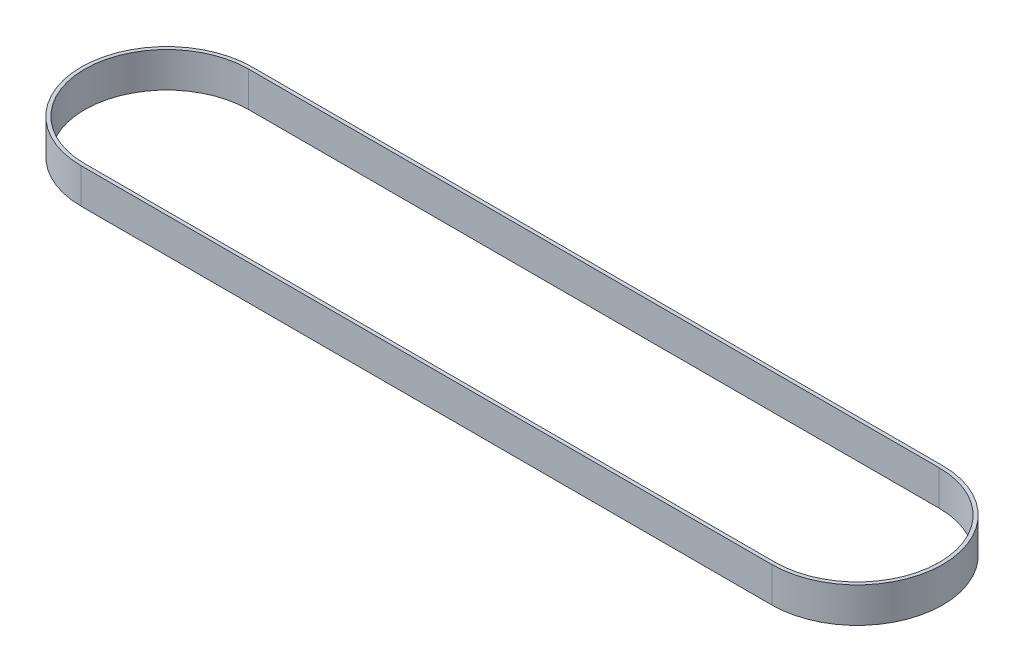
ISO-10303-21;
HEADER;
FILE_DESCRIPTION(('STEP AP214'),'2;1');
FILE_NAME('part.step','',(''),(''),'','','');
FILE_SCHEMA(('AUTOMOTIVE_DESIGN { 1 0 10303 214 1 1 1 1 }'));
ENDSEC;
DATA;
#1=APPLICATION_CONTEXT('core data for automotive mechanical design processes');
#2=APPLICATION_PROTOCOL_DEFINITION('international standard','automotive_design',2000,#1);
#3=PRODUCT_CONTEXT('',#1,'mechanical');
#4=PRODUCT('Part','Part','',(#3));
#5=PRODUCT_RELATED_PRODUCT_CATEGORY('part','',(#4));
#6=PRODUCT_DEFINITION_FORMATION('','',#4);
#7=PRODUCT_DEFINITION_CONTEXT('part definition',#1,'design');
#8=PRODUCT_DEFINITION('design','',#6,#7);
#9=PRODUCT_DEFINITION_SHAPE('','',#8);
#10=(LENGTH_UNIT() NAMED_UNIT(*) SI_UNIT(.MILLI.,.METRE.));
#11=(NAMED_UNIT(*) PLANE_ANGLE_UNIT() SI_UNIT($,.RADIAN.));
#12=(NAMED_UNIT(*) SI_UNIT($,.STERADIAN.) SOLID_ANGLE_UNIT());
#13=UNCERTAINTY_MEASURE_WITH_UNIT(LENGTH_MEASURE(1.E-05),#10,'distance_accuracy_value','');
#14=(GEOMETRIC_REPRESENTATION_CONTEXT(3) GLOBAL_UNCERTAINTY_ASSIGNED_CONTEXT((#13)) GLOBAL_UNIT_ASSIGNED_CONTEXT((#10,
#11,#12)) REPRESENTATION_CONTEXT('',''));
#15=CARTESIAN_POINT('',(0.,0.,0.));
#16=DIRECTION('',(0.,0.,1.));
#17=DIRECTION('',(1.,0.,0.));
#18=AXIS2_PLACEMENT_3D('',#15,#16,#17);
#19=CARTESIAN_POINT('',(0.,15.,-36.5379));
#20=DIRECTION('',(0.,0.,1.));
#21=DIRECTION('',(1.,0.,0.));
#22=AXIS2_PLACEMENT_3D('',#19,#20,#21);
#23=PLANE('',#22);
#24=DIRECTION('',(0.,-1.,0.));
#25=VECTOR('',#24,1.);
#26=CARTESIAN_POINT('',(0.,15.,-36.5379));
#27=LINE('',#26,#25);
#28=CARTESIAN_POINT('',(0.,15.,-36.5379));
#29=VERTEX_POINT('',#28);
#30=CARTESIAN_POINT('',(0.,0.,-36.5379));
#31=VERTEX_POINT('',#30);
#32=EDGE_CURVE('E78',#29,#31,#27,.T.);
#33=ORIENTED_EDGE('',*,*,#32,.F.);
#34=DIRECTION('',(1.,0.,0.));
#35=VECTOR('',#34,1.);
#36=CARTESIAN_POINT('',(0.,15.,-36.5379));
#37=LINE('',#36,#35);
#38=CARTESIAN_POINT('',(295.0718,15.,-36.5379));
#39=VERTEX_POINT('',#38);
#40=EDGE_CURVE('E80',#39,#29,#37,.F.);
#41=ORIENTED_EDGE('',*,*,#40,.F.);
#42=DIRECTION('',(0.,-1.,0.));
#43=VECTOR('',#42,1.);
#44=CARTESIAN_POINT('',(295.0718,15.,-36.5379));
#45=LINE('',#44,#43);
#46=CARTESIAN_POINT('',(295.0718,0.,-36.5379));
#47=VERTEX_POINT('',#46);
#48=EDGE_CURVE('E152',#47,#39,#45,.F.);
#49=ORIENTED_EDGE('',*,*,#48,.F.);
#50=DIRECTION('',(1.,0.,0.));
#51=VECTOR('',#50,1.);
#52=CARTESIAN_POINT('',(0.,0.,-36.5379));
#53=LINE('',#52,#51);
#54=EDGE_CURVE('E82',#47,#31,#53,.F.);
#55=ORIENTED_EDGE('',*,*,#54,.T.);
#56=EDGE_LOOP('',(#33,#41,#49,#55));
#57=FACE_BOUND('',#56,.T.);
#58=ADVANCED_FACE('F16',(#57),#23,.F.);
#59=CARTESIAN_POINT('',(0.,15.,-35.0139));
#60=DIRECTION('',(0.,0.,1.));
#61=DIRECTION('',(1.,0.,0.));
#62=AXIS2_PLACEMENT_3D('',#59,#60,#61);
#63=PLANE('',#62);
#64=DIRECTION('',(1.,0.,0.));
#65=VECTOR('',#64,1.);
#66=CARTESIAN_POINT('',(0.,15.,-35.0139));
#67=LINE('',#66,#65);
#68=CARTESIAN_POINT('',(0.,15.,-35.0139));
#69=VERTEX_POINT('',#68);
#70=CARTESIAN_POINT('',(295.0718,15.,-35.0139));
#71=VERTEX_POINT('',#70);
#72=EDGE_CURVE('E113',#69,#71,#67,.T.);
#73=ORIENTED_EDGE('',*,*,#72,.F.);
#74=DIRECTION('',(0.,-1.,0.));
#75=VECTOR('',#74,1.);
#76=CARTESIAN_POINT('',(0.,15.,-35.0139));
#77=LINE('',#76,#75);
#78=CARTESIAN_POINT('',(0.,0.,-35.0139));
#79=VERTEX_POINT('',#78);
#80=EDGE_CURVE('E88',#69,#79,#77,.T.);
#81=ORIENTED_EDGE('',*,*,#80,.T.);
#82=DIRECTION('',(1.,0.,0.));
#83=VECTOR('',#82,1.);
#84=CARTESIAN_POINT('',(0.,0.,-35.0139));
#85=LINE('',#84,#83);
#86=CARTESIAN_POINT('',(295.0718,0.,-35.0139));
#87=VERTEX_POINT('',#86);
#88=EDGE_CURVE('E126',#79,#87,#85,.T.);
#89=ORIENTED_EDGE('',*,*,#88,.T.);
#90=DIRECTION('',(0.,-1.,0.));
#91=VECTOR('',#90,1.);
#92=CARTESIAN_POINT('',(295.0718,15.,-35.0139));
#93=LINE('',#92,#91);
#94=EDGE_CURVE('E148',#87,#71,#93,.F.);
#95=ORIENTED_EDGE('',*,*,#94,.T.);
#96=EDGE_LOOP('',(#73,#81,#89,#95));
#97=FACE_BOUND('',#96,.T.);
#98=ADVANCED_FACE('F184',(#97),#63,.T.);
#99=CARTESIAN_POINT('',(295.0718,15.,0.));
#100=DIRECTION('',(0.,-1.,0.));
#101=DIRECTION('',(0.,0.,-1.));
#102=AXIS2_PLACEMENT_3D('',#99,#100,#101);
#103=CYLINDRICAL_SURFACE('',#102,35.0139);
#104=DIRECTION('',(0.,1.,0.));
#105=VECTOR('',#104,1.);
#106=CARTESIAN_POINT('',(295.0718,15.,35.0139));
#107=LINE('',#106,#105);
#108=CARTESIAN_POINT('',(295.0718,15.,35.0139));
#109=VERTEX_POINT('',#108);
#110=CARTESIAN_POINT('',(295.0718,0.,35.0139));
#111=VERTEX_POINT('',#110);
#112=EDGE_CURVE('E117',#109,#111,#107,.F.);
#113=ORIENTED_EDGE('',*,*,#112,.F.);
#114=CARTESIAN_POINT('',(295.0718,15.,0.));
#115=DIRECTION('',(0.,-1.,0.));
#116=DIRECTION('',(0.,0.,-1.));
#117=AXIS2_PLACEMENT_3D('',#114,#115,#116);
#118=CIRCLE('',#117,35.0139);
#119=EDGE_CURVE('E140',#71,#109,#118,.T.);
#120=ORIENTED_EDGE('',*,*,#119,.F.);
#121=ORIENTED_EDGE('',*,*,#94,.F.);
#122=CARTESIAN_POINT('',(295.0718,0.,0.));
#123=DIRECTION('',(0.,-1.,0.));
#124=DIRECTION('',(0.,0.,-1.));
#125=AXIS2_PLACEMENT_3D('',#122,#123,#124);
#126=CIRCLE('',#125,35.0139);
#127=EDGE_CURVE('E158',#87,#111,#126,.T.);
#128=ORIENTED_EDGE('',*,*,#127,.T.);
#129=EDGE_LOOP('',(#113,#120,#121,#128));
#130=FACE_BOUND('',#129,.T.);
#131=ADVANCED_FACE('F190',(#130),#103,.F.);
#132=CARTESIAN_POINT('',(0.,15.,35.0139));
#133=DIRECTION('',(0.,0.,-1.));
#134=DIRECTION('',(-1.,0.,0.));
#135=AXIS2_PLACEMENT_3D('',#132,#133,#134);
#136=PLANE('',#135);
#137=DIRECTION('',(1.,0.,0.));
#138=VECTOR('',#137,1.);
#139=CARTESIAN_POINT('',(0.,15.,35.0139));
#140=LINE('',#139,#138);
#141=CARTESIAN_POINT('',(0.,15.,35.0139));
#142=VERTEX_POINT('',#141);
#143=EDGE_CURVE('E97',#109,#142,#140,.F.);
#144=ORIENTED_EDGE('',*,*,#143,.F.);
#145=ORIENTED_EDGE('',*,*,#112,.T.);
#146=DIRECTION('',(1.,0.,0.));
#147=VECTOR('',#146,1.);
#148=CARTESIAN_POINT('',(0.,0.,35.0139));
#149=LINE('',#148,#147);
#150=CARTESIAN_POINT('',(0.,0.,35.0139));
#151=VERTEX_POINT('',#150);
#152=EDGE_CURVE('E157',#111,#151,#149,.F.);
#153=ORIENTED_EDGE('',*,*,#152,.T.);
#154=DIRECTION('',(0.,-1.,0.));
#155=VECTOR('',#154,1.);
#156=CARTESIAN_POINT('',(0.,15.,35.0139));
#157=LINE('',#156,#155);
#158=EDGE_CURVE('E114',#151,#142,#157,.F.);
#159=ORIENTED_EDGE('',*,*,#158,.T.);
#160=EDGE_LOOP('',(#144,#145,#153,#159));
#161=FACE_BOUND('',#160,.T.);
#162=ADVANCED_FACE('F173',(#161),#136,.T.);
#163=CARTESIAN_POINT('',(0.,15.,0.));
#164=DIRECTION('',(0.,-1.,0.));
#165=DIRECTION('',(0.,0.,-1.));
#166=AXIS2_PLACEMENT_3D('',#163,#164,#165);
#167=CYLINDRICAL_SURFACE('',#166,35.0139);
#168=ORIENTED_EDGE('',*,*,#80,.F.);
#169=CARTESIAN_POINT('',(0.,15.,0.));
#170=DIRECTION('',(0.,-1.,0.));
#171=DIRECTION('',(0.,0.,-1.));
#172=AXIS2_PLACEMENT_3D('',#169,#170,#171);
#173=CIRCLE('',#172,35.0139);
#174=EDGE_CURVE('E110',#142,#69,#173,.T.);
#175=ORIENTED_EDGE('',*,*,#174,.F.);
#176=ORIENTED_EDGE('',*,*,#158,.F.);
#177=CARTESIAN_POINT('',(0.,0.,0.));
#178=DIRECTION('',(0.,-1.,0.));
#179=DIRECTION('',(0.,0.,-1.));
#180=AXIS2_PLACEMENT_3D('',#177,#178,#179);
#181=CIRCLE('',#180,35.0139);
#182=EDGE_CURVE('E121',#151,#79,#181,.T.);
#183=ORIENTED_EDGE('',*,*,#182,.T.);
#184=EDGE_LOOP('',(#168,#175,#176,#183));
#185=FACE_BOUND('',#184,.T.);
#186=ADVANCED_FACE('F182',(#185),#167,.F.);
#187=CARTESIAN_POINT('',(0.,15.,0.));
#188=DIRECTION('',(0.,-1.,0.));
#189=DIRECTION('',(0.,0.,-1.));
#190=AXIS2_PLACEMENT_3D('',#187,#188,#189);
#191=CYLINDRICAL_SURFACE('',#190,36.5379);
#192=CARTESIAN_POINT('',(0.,15.,0.));
#193=DIRECTION('',(0.,-1.,0.));
#194=DIRECTION('',(0.,0.,-1.));
#195=AXIS2_PLACEMENT_3D('',#192,#193,#194);
#196=CIRCLE('',#195,36.5379);
#197=CARTESIAN_POINT('',(0.,15.,36.5379));
#198=VERTEX_POINT('',#197);
#199=EDGE_CURVE('E19',#29,#198,#196,.F.);
#200=ORIENTED_EDGE('',*,*,#199,.F.);
#201=ORIENTED_EDGE('',*,*,#32,.T.);
#202=CARTESIAN_POINT('',(0.,0.,0.));
#203=DIRECTION('',(0.,-1.,0.));
#204=DIRECTION('',(0.,0.,-1.));
#205=AXIS2_PLACEMENT_3D('',#202,#203,#204);
#206=CIRCLE('',#205,36.5379);
#207=CARTESIAN_POINT('',(0.,0.,36.5379));
#208=VERTEX_POINT('',#207);
#209=EDGE_CURVE('E123',#31,#208,#206,.F.);
#210=ORIENTED_EDGE('',*,*,#209,.T.);
#211=DIRECTION('',(0.,1.,0.));
#212=VECTOR('',#211,1.);
#213=CARTESIAN_POINT('',(0.,15.,36.5379));
#214=LINE('',#213,#212);
#215=EDGE_CURVE('E102',#208,#198,#214,.T.);
#216=ORIENTED_EDGE('',*,*,#215,.T.);
#217=EDGE_LOOP('',(#200,#201,#210,#216));
#218=FACE_BOUND('',#217,.T.);
#219=ADVANCED_FACE('F100',(#218),#191,.T.);
#220=CARTESIAN_POINT('',(0.,15.,0.));
#221=DIRECTION('',(0.,1.,0.));
#222=DIRECTION('',(0.,0.,1.));
#223=AXIS2_PLACEMENT_3D('',#220,#221,#222);
#224=PLANE('',#223);
#225=ORIENTED_EDGE('',*,*,#72,.T.);
#226=ORIENTED_EDGE('',*,*,#119,.T.);
#227=ORIENTED_EDGE('',*,*,#143,.T.);
#228=ORIENTED_EDGE('',*,*,#174,.T.);
#229=EDGE_LOOP('',(#225,#226,#227,#228));
#230=FACE_BOUND('',#229,.T.);
#231=CARTESIAN_POINT('',(295.0718,15.,0.));
#232=DIRECTION('',(0.,-1.,0.));
#233=DIRECTION('',(0.,0.,-1.));
#234=AXIS2_PLACEMENT_3D('',#231,#232,#233);
#235=CIRCLE('',#234,36.5379);
#236=CARTESIAN_POINT('',(295.0718,15.,36.5379));
#237=VERTEX_POINT('',#236);
#238=EDGE_CURVE('E95',#39,#237,#235,.T.);
#239=ORIENTED_EDGE('',*,*,#238,.F.);
#240=ORIENTED_EDGE('',*,*,#40,.T.);
#241=ORIENTED_EDGE('',*,*,#199,.T.);
#242=DIRECTION('',(-1.,0.,0.));
#243=VECTOR('',#242,1.);
#244=CARTESIAN_POINT('',(0.,15.,36.5379));
#245=LINE('',#244,#243);
#246=EDGE_CURVE('E120',#198,#237,#245,.F.);
#247=ORIENTED_EDGE('',*,*,#246,.T.);
#248=EDGE_LOOP('',(#239,#240,#241,#247));
#249=FACE_BOUND('',#248,.T.);
#250=ADVANCED_FACE('F92',(#230,#249),#224,.T.);
#251=CARTESIAN_POINT('',(295.0718,15.,0.));
#252=DIRECTION('',(0.,-1.,0.));
#253=DIRECTION('',(0.,0.,-1.));
#254=AXIS2_PLACEMENT_3D('',#251,#252,#253);
#255=CYLINDRICAL_SURFACE('',#254,36.5379);
#256=ORIENTED_EDGE('',*,*,#238,.T.);
#257=DIRECTION('',(0.,1.,0.));
#258=VECTOR('',#257,1.);
#259=CARTESIAN_POINT('',(295.0718,15.,36.5379));
#260=LINE('',#259,#258);
#261=CARTESIAN_POINT('',(295.0718,0.,36.5379));
#262=VERTEX_POINT('',#261);
#263=EDGE_CURVE('E26',#237,#262,#260,.F.);
#264=ORIENTED_EDGE('',*,*,#263,.T.);
#265=CARTESIAN_POINT('',(295.0718,0.,0.));
#266=DIRECTION('',(0.,-1.,0.));
#267=DIRECTION('',(0.,0.,-1.));
#268=AXIS2_PLACEMENT_3D('',#265,#266,#267);
#269=CIRCLE('',#268,36.5379);
#270=EDGE_CURVE('E38',#262,#47,#269,.F.);
#271=ORIENTED_EDGE('',*,*,#270,.T.);
#272=ORIENTED_EDGE('',*,*,#48,.T.);
#273=EDGE_LOOP('',(#256,#264,#271,#272));
#274=FACE_BOUND('',#273,.T.);
#275=ADVANCED_FACE('F209',(#274),#255,.T.);
#276=CARTESIAN_POINT('',(0.,0.,0.));
#277=DIRECTION('',(0.,1.,0.));
#278=DIRECTION('',(0.,0.,1.));
#279=AXIS2_PLACEMENT_3D('',#276,#277,#278);
#280=PLANE('',#279);
#281=ORIENTED_EDGE('',*,*,#152,.F.);
#282=ORIENTED_EDGE('',*,*,#127,.F.);
#283=ORIENTED_EDGE('',*,*,#88,.F.);
#284=ORIENTED_EDGE('',*,*,#182,.F.);
#285=EDGE_LOOP('',(#281,#282,#283,#284));
#286=FACE_BOUND('',#285,.T.);
#287=ORIENTED_EDGE('',*,*,#54,.F.);
#288=ORIENTED_EDGE('',*,*,#270,.F.);
#289=DIRECTION('',(-1.,0.,0.));
#290=VECTOR('',#289,1.);
#291=CARTESIAN_POINT('',(0.,0.,36.5379));
#292=LINE('',#291,#290);
#293=EDGE_CURVE('E11',#262,#208,#292,.T.);
#294=ORIENTED_EDGE('',*,*,#293,.T.);
#295=ORIENTED_EDGE('',*,*,#209,.F.);
#296=EDGE_LOOP('',(#287,#288,#294,#295));
#297=FACE_BOUND('',#296,.T.);
#298=ADVANCED_FACE('F194',(#286,#297),#280,.F.);
#299=CARTESIAN_POINT('',(0.,15.,36.5379));
#300=DIRECTION('',(0.,0.,-1.));
#301=DIRECTION('',(-1.,0.,0.));
#302=AXIS2_PLACEMENT_3D('',#299,#300,#301);
#303=PLANE('',#302);
#304=ORIENTED_EDGE('',*,*,#263,.F.);
#305=ORIENTED_EDGE('',*,*,#246,.F.);
#306=ORIENTED_EDGE('',*,*,#215,.F.);
#307=ORIENTED_EDGE('',*,*,#293,.F.);
#308=EDGE_LOOP('',(#304,#305,#306,#307));
#309=FACE_BOUND('',#308,.T.);
#310=ADVANCED_FACE('F207',(#309),#303,.F.);
#311=CLOSED_SHELL('',(#58,#98,#131,#162,#186,#219,#250,#275,#298,#310));
#312=MANIFOLD_SOLID_BREP('B1',#311);
#313=ADVANCED_BREP_SHAPE_REPRESENTATION('',(#18,#312),#14);
#314=SHAPE_DEFINITION_REPRESENTATION(#9,#313);
ENDSEC;
END-ISO-10303-21;
